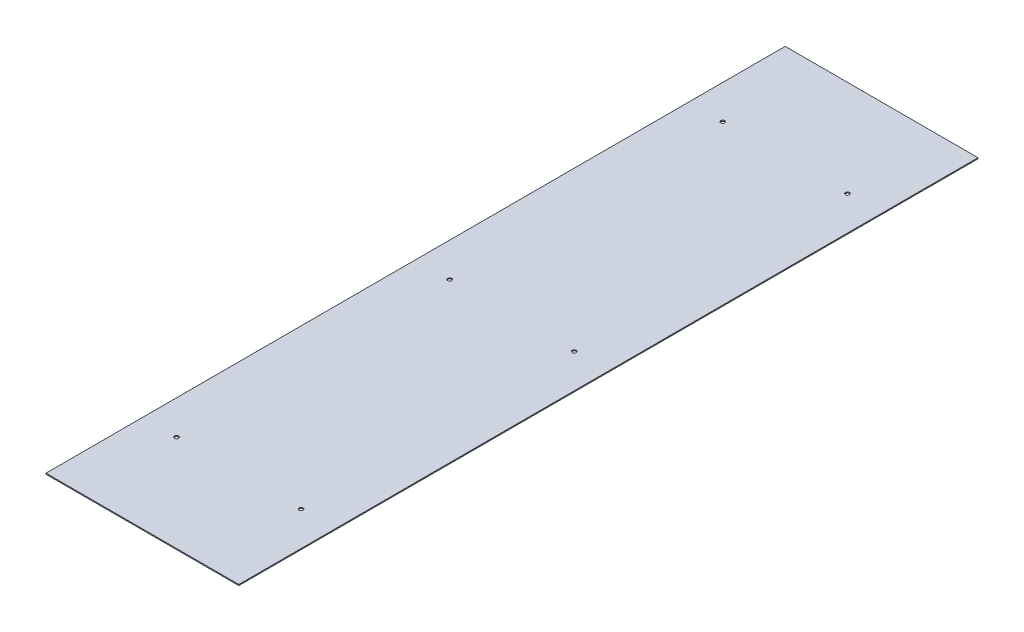
ISO-10303-21;
HEADER;
FILE_DESCRIPTION(('STEP AP214'),'2;1');
FILE_NAME('part.step','',(''),(''),'','','');
FILE_SCHEMA(('AUTOMOTIVE_DESIGN { 1 0 10303 214 1 1 1 1 }'));
ENDSEC;
DATA;
#1=APPLICATION_CONTEXT('core data for automotive mechanical design processes');
#2=APPLICATION_PROTOCOL_DEFINITION('international standard','automotive_design',2000,#1);
#3=PRODUCT_CONTEXT('',#1,'mechanical');
#4=PRODUCT('Part','Part','',(#3));
#5=PRODUCT_RELATED_PRODUCT_CATEGORY('part','',(#4));
#6=PRODUCT_DEFINITION_FORMATION('','',#4);
#7=PRODUCT_DEFINITION_CONTEXT('part definition',#1,'design');
#8=PRODUCT_DEFINITION('design','',#6,#7);
#9=PRODUCT_DEFINITION_SHAPE('','',#8);
#10=(LENGTH_UNIT() NAMED_UNIT(*) SI_UNIT(.MILLI.,.METRE.));
#11=(NAMED_UNIT(*) PLANE_ANGLE_UNIT() SI_UNIT($,.RADIAN.));
#12=(NAMED_UNIT(*) SI_UNIT($,.STERADIAN.) SOLID_ANGLE_UNIT());
#13=UNCERTAINTY_MEASURE_WITH_UNIT(LENGTH_MEASURE(1.E-05),#10,'distance_accuracy_value','');
#14=(GEOMETRIC_REPRESENTATION_CONTEXT(3) GLOBAL_UNCERTAINTY_ASSIGNED_CONTEXT((#13)) GLOBAL_UNIT_ASSIGNED_CONTEXT((#10,
#11,#12)) REPRESENTATION_CONTEXT('',''));
#15=CARTESIAN_POINT('',(0.,0.,0.));
#16=DIRECTION('',(0.,0.,1.));
#17=DIRECTION('',(1.,0.,0.));
#18=AXIS2_PLACEMENT_3D('',#15,#16,#17);
#19=CARTESIAN_POINT('',(4380.94840105623,-1.5875,584.2));
#20=DIRECTION('',(-1.,0.,0.));
#21=DIRECTION('',(0.,0.,1.));
#22=AXIS2_PLACEMENT_3D('',#19,#20,#21);
#23=PLANE('',#22);
#24=DIRECTION('',(0.,0.,1.));
#25=VECTOR('',#24,1.);
#26=CARTESIAN_POINT('',(4380.94840105623,0.,584.2));
#27=LINE('',#26,#25);
#28=CARTESIAN_POINT('',(4380.94840105623,0.,0.));
#29=VERTEX_POINT('',#28);
#30=CARTESIAN_POINT('',(4380.94840105623,0.,1168.4));
#31=VERTEX_POINT('',#30);
#32=EDGE_CURVE('E104',#29,#31,#27,.T.);
#33=ORIENTED_EDGE('',*,*,#32,.F.);
#34=DIRECTION('',(0.,1.,0.));
#35=VECTOR('',#34,1.);
#36=CARTESIAN_POINT('',(4380.94840105623,-1.5875,0.));
#37=LINE('',#36,#35);
#38=CARTESIAN_POINT('',(4380.94840105623,-1.5875,0.));
#39=VERTEX_POINT('',#38);
#40=EDGE_CURVE('E11',#39,#29,#37,.T.);
#41=ORIENTED_EDGE('',*,*,#40,.F.);
#42=DIRECTION('',(0.,0.,1.));
#43=VECTOR('',#42,1.);
#44=CARTESIAN_POINT('',(4380.94840105623,-1.5875,584.2));
#45=LINE('',#44,#43);
#46=CARTESIAN_POINT('',(4380.94840105623,-1.5875,1168.4));
#47=VERTEX_POINT('',#46);
#48=EDGE_CURVE('E81',#39,#47,#45,.T.);
#49=ORIENTED_EDGE('',*,*,#48,.T.);
#50=DIRECTION('',(0.,1.,0.));
#51=VECTOR('',#50,1.);
#52=CARTESIAN_POINT('',(4380.94840105623,-1.5875,1168.4));
#53=LINE('',#52,#51);
#54=EDGE_CURVE('E40',#47,#31,#53,.T.);
#55=ORIENTED_EDGE('',*,*,#54,.T.);
#56=EDGE_LOOP('',(#33,#41,#49,#55));
#57=FACE_BOUND('',#56,.T.);
#58=ADVANCED_FACE('F16',(#57),#23,.T.);
#59=CARTESIAN_POINT('',(4533.34840105623,-1.5875,0.));
#60=DIRECTION('',(0.,0.,1.));
#61=DIRECTION('',(1.,0.,0.));
#62=AXIS2_PLACEMENT_3D('',#59,#60,#61);
#63=PLANE('',#62);
#64=DIRECTION('',(1.,0.,0.));
#65=VECTOR('',#64,1.);
#66=CARTESIAN_POINT('',(4533.34840105623,0.,0.));
#67=LINE('',#66,#65);
#68=CARTESIAN_POINT('',(4685.74840105623,0.,0.));
#69=VERTEX_POINT('',#68);
#70=EDGE_CURVE('E88',#29,#69,#67,.T.);
#71=ORIENTED_EDGE('',*,*,#70,.T.);
#72=DIRECTION('',(0.,1.,0.));
#73=VECTOR('',#72,1.);
#74=CARTESIAN_POINT('',(4685.74840105623,-1.5875,0.));
#75=LINE('',#74,#73);
#76=CARTESIAN_POINT('',(4685.74840105623,-1.5875,0.));
#77=VERTEX_POINT('',#76);
#78=EDGE_CURVE('E26',#77,#69,#75,.T.);
#79=ORIENTED_EDGE('',*,*,#78,.F.);
#80=DIRECTION('',(1.,0.,0.));
#81=VECTOR('',#80,1.);
#82=CARTESIAN_POINT('',(4533.34840105623,-1.5875,0.));
#83=LINE('',#82,#81);
#84=EDGE_CURVE('E75',#39,#77,#83,.T.);
#85=ORIENTED_EDGE('',*,*,#84,.F.);
#86=ORIENTED_EDGE('',*,*,#40,.T.);
#87=EDGE_LOOP('',(#71,#79,#85,#86));
#88=FACE_BOUND('',#87,.T.);
#89=ADVANCED_FACE('F86',(#88),#63,.F.);
#90=CARTESIAN_POINT('',(4685.74840105623,-1.5875,584.2));
#91=DIRECTION('',(-1.,0.,0.));
#92=DIRECTION('',(0.,0.,1.));
#93=AXIS2_PLACEMENT_3D('',#90,#91,#92);
#94=PLANE('',#93);
#95=DIRECTION('',(0.,0.,1.));
#96=VECTOR('',#95,1.);
#97=CARTESIAN_POINT('',(4685.74840105623,0.,584.2));
#98=LINE('',#97,#96);
#99=CARTESIAN_POINT('',(4685.74840105623,0.,1168.4));
#100=VERTEX_POINT('',#99);
#101=EDGE_CURVE('E110',#69,#100,#98,.T.);
#102=ORIENTED_EDGE('',*,*,#101,.T.);
#103=DIRECTION('',(0.,1.,0.));
#104=VECTOR('',#103,1.);
#105=CARTESIAN_POINT('',(4685.74840105623,-1.5875,1168.4));
#106=LINE('',#105,#104);
#107=CARTESIAN_POINT('',(4685.74840105623,-1.5875,1168.4));
#108=VERTEX_POINT('',#107);
#109=EDGE_CURVE('E58',#108,#100,#106,.T.);
#110=ORIENTED_EDGE('',*,*,#109,.F.);
#111=DIRECTION('',(0.,0.,1.));
#112=VECTOR('',#111,1.);
#113=CARTESIAN_POINT('',(4685.74840105623,-1.5875,584.2));
#114=LINE('',#113,#112);
#115=EDGE_CURVE('E80',#77,#108,#114,.T.);
#116=ORIENTED_EDGE('',*,*,#115,.F.);
#117=ORIENTED_EDGE('',*,*,#78,.T.);
#118=EDGE_LOOP('',(#102,#110,#116,#117));
#119=FACE_BOUND('',#118,.T.);
#120=ADVANCED_FACE('F93',(#119),#94,.F.);
#121=CARTESIAN_POINT('',(4533.34840105623,-1.5875,1168.4));
#122=DIRECTION('',(0.,0.,1.));
#123=DIRECTION('',(1.,0.,0.));
#124=AXIS2_PLACEMENT_3D('',#121,#122,#123);
#125=PLANE('',#124);
#126=DIRECTION('',(1.,0.,0.));
#127=VECTOR('',#126,1.);
#128=CARTESIAN_POINT('',(4533.34840105623,0.,1168.4));
#129=LINE('',#128,#127);
#130=EDGE_CURVE('E112',#31,#100,#129,.T.);
#131=ORIENTED_EDGE('',*,*,#130,.F.);
#132=ORIENTED_EDGE('',*,*,#54,.F.);
#133=DIRECTION('',(1.,0.,0.));
#134=VECTOR('',#133,1.);
#135=CARTESIAN_POINT('',(4533.34840105623,-1.5875,1168.4));
#136=LINE('',#135,#134);
#137=EDGE_CURVE('E95',#47,#108,#136,.T.);
#138=ORIENTED_EDGE('',*,*,#137,.T.);
#139=ORIENTED_EDGE('',*,*,#109,.T.);
#140=EDGE_LOOP('',(#131,#132,#138,#139));
#141=FACE_BOUND('',#140,.T.);
#142=ADVANCED_FACE('F171',(#141),#125,.T.);
#143=CARTESIAN_POINT('',(4533.34840105623,-1.5875,584.2));
#144=DIRECTION('',(0.,-1.,0.));
#145=DIRECTION('',(1.,0.,0.));
#146=AXIS2_PLACEMENT_3D('',#143,#144,#145);
#147=PLANE('',#146);
#148=CARTESIAN_POINT('',(4631.77340105623,-1.58750000000007,584.2));
#149=DIRECTION('',(0.,-1.,0.));
#150=DIRECTION('',(0.,0.,-1.));
#151=AXIS2_PLACEMENT_3D('',#148,#149,#150);
#152=CIRCLE('',#151,3.1749999999997);
#153=CARTESIAN_POINT('',(4631.77340105623,-1.58750000000007,581.025));
#154=VERTEX_POINT('',#153);
#155=EDGE_CURVE('E158',#154,#154,#152,.T.);
#156=ORIENTED_EDGE('',*,*,#155,.F.);
#157=EDGE_LOOP('',(#156));
#158=FACE_BOUND('',#157,.T.);
#159=CARTESIAN_POINT('',(4434.92340105623,-1.58750000000007,584.2));
#160=DIRECTION('',(0.,-1.,0.));
#161=DIRECTION('',(0.,0.,-1.));
#162=AXIS2_PLACEMENT_3D('',#159,#160,#161);
#163=CIRCLE('',#162,3.1749999999997);
#164=CARTESIAN_POINT('',(4434.92340105623,-1.58750000000007,581.025));
#165=VERTEX_POINT('',#164);
#166=EDGE_CURVE('E141',#165,#165,#163,.T.);
#167=ORIENTED_EDGE('',*,*,#166,.F.);
#168=EDGE_LOOP('',(#167));
#169=FACE_BOUND('',#168,.T.);
#170=CARTESIAN_POINT('',(4631.77340105623,-1.58750000000007,152.4));
#171=DIRECTION('',(0.,-1.,0.));
#172=DIRECTION('',(0.,0.,-1.));
#173=AXIS2_PLACEMENT_3D('',#170,#171,#172);
#174=CIRCLE('',#173,3.1749999999997);
#175=CARTESIAN_POINT('',(4631.77340105623,-1.58750000000007,149.225));
#176=VERTEX_POINT('',#175);
#177=EDGE_CURVE('E137',#176,#176,#174,.T.);
#178=ORIENTED_EDGE('',*,*,#177,.F.);
#179=EDGE_LOOP('',(#178));
#180=FACE_BOUND('',#179,.T.);
#181=CARTESIAN_POINT('',(4434.92340105623,-1.58750000000007,152.4));
#182=DIRECTION('',(0.,-1.,0.));
#183=DIRECTION('',(0.,0.,-1.));
#184=AXIS2_PLACEMENT_3D('',#181,#182,#183);
#185=CIRCLE('',#184,3.1749999999997);
#186=CARTESIAN_POINT('',(4434.92340105623,-1.58750000000007,149.225));
#187=VERTEX_POINT('',#186);
#188=EDGE_CURVE('E133',#187,#187,#185,.T.);
#189=ORIENTED_EDGE('',*,*,#188,.F.);
#190=EDGE_LOOP('',(#189));
#191=FACE_BOUND('',#190,.T.);
#192=CARTESIAN_POINT('',(4631.77340105623,-1.58750000000007,1016.));
#193=DIRECTION('',(0.,-1.,0.));
#194=DIRECTION('',(0.,0.,-1.));
#195=AXIS2_PLACEMENT_3D('',#192,#193,#194);
#196=CIRCLE('',#195,3.1749999999997);
#197=CARTESIAN_POINT('',(4631.77340105623,-1.58750000000007,1012.825));
#198=VERTEX_POINT('',#197);
#199=EDGE_CURVE('E128',#198,#198,#196,.T.);
#200=ORIENTED_EDGE('',*,*,#199,.F.);
#201=EDGE_LOOP('',(#200));
#202=FACE_BOUND('',#201,.T.);
#203=CARTESIAN_POINT('',(4434.92340105623,-1.58750000000007,1016.));
#204=DIRECTION('',(0.,-1.,0.));
#205=DIRECTION('',(0.,0.,-1.));
#206=AXIS2_PLACEMENT_3D('',#203,#204,#205);
#207=CIRCLE('',#206,3.1749999999997);
#208=CARTESIAN_POINT('',(4434.92340105623,-1.58750000000007,1012.825));
#209=VERTEX_POINT('',#208);
#210=EDGE_CURVE('E123',#209,#209,#207,.T.);
#211=ORIENTED_EDGE('',*,*,#210,.F.);
#212=EDGE_LOOP('',(#211));
#213=FACE_BOUND('',#212,.T.);
#214=ORIENTED_EDGE('',*,*,#48,.F.);
#215=ORIENTED_EDGE('',*,*,#84,.T.);
#216=ORIENTED_EDGE('',*,*,#115,.T.);
#217=ORIENTED_EDGE('',*,*,#137,.F.);
#218=EDGE_LOOP('',(#214,#215,#216,#217));
#219=FACE_BOUND('',#218,.T.);
#220=ADVANCED_FACE('F77',(#158,#169,#180,#191,#202,#213,#219),#147,.T.);
#221=CARTESIAN_POINT('',(4533.34840105623,0.,584.2));
#222=DIRECTION('',(0.,-1.,0.));
#223=DIRECTION('',(1.,0.,0.));
#224=AXIS2_PLACEMENT_3D('',#221,#222,#223);
#225=PLANE('',#224);
#226=CARTESIAN_POINT('',(4631.77340105623,0.,584.2));
#227=DIRECTION('',(0.,-1.,0.));
#228=DIRECTION('',(0.,0.,-1.));
#229=AXIS2_PLACEMENT_3D('',#226,#227,#228);
#230=CIRCLE('',#229,3.1749999999997);
#231=CARTESIAN_POINT('',(4631.77340105623,0.,581.025));
#232=VERTEX_POINT('',#231);
#233=EDGE_CURVE('E19',#232,#232,#230,.F.);
#234=ORIENTED_EDGE('',*,*,#233,.F.);
#235=EDGE_LOOP('',(#234));
#236=FACE_BOUND('',#235,.T.);
#237=CARTESIAN_POINT('',(4434.92340105623,0.,584.2));
#238=DIRECTION('',(0.,-1.,0.));
#239=DIRECTION('',(0.,0.,-1.));
#240=AXIS2_PLACEMENT_3D('',#237,#238,#239);
#241=CIRCLE('',#240,3.1749999999997);
#242=CARTESIAN_POINT('',(4434.92340105623,0.,581.025));
#243=VERTEX_POINT('',#242);
#244=EDGE_CURVE('E138',#243,#243,#241,.F.);
#245=ORIENTED_EDGE('',*,*,#244,.F.);
#246=EDGE_LOOP('',(#245));
#247=FACE_BOUND('',#246,.T.);
#248=CARTESIAN_POINT('',(4631.77340105623,0.,152.4));
#249=DIRECTION('',(0.,-1.,0.));
#250=DIRECTION('',(0.,0.,-1.));
#251=AXIS2_PLACEMENT_3D('',#248,#249,#250);
#252=CIRCLE('',#251,3.1749999999997);
#253=CARTESIAN_POINT('',(4631.77340105623,0.,149.225));
#254=VERTEX_POINT('',#253);
#255=EDGE_CURVE('E134',#254,#254,#252,.F.);
#256=ORIENTED_EDGE('',*,*,#255,.F.);
#257=EDGE_LOOP('',(#256));
#258=FACE_BOUND('',#257,.T.);
#259=CARTESIAN_POINT('',(4434.92340105623,0.,152.4));
#260=DIRECTION('',(0.,-1.,0.));
#261=DIRECTION('',(0.,0.,-1.));
#262=AXIS2_PLACEMENT_3D('',#259,#260,#261);
#263=CIRCLE('',#262,3.1749999999997);
#264=CARTESIAN_POINT('',(4434.92340105623,0.,149.225));
#265=VERTEX_POINT('',#264);
#266=EDGE_CURVE('E129',#265,#265,#263,.F.);
#267=ORIENTED_EDGE('',*,*,#266,.F.);
#268=EDGE_LOOP('',(#267));
#269=FACE_BOUND('',#268,.T.);
#270=CARTESIAN_POINT('',(4631.77340105623,0.,1016.));
#271=DIRECTION('',(0.,-1.,0.));
#272=DIRECTION('',(0.,0.,-1.));
#273=AXIS2_PLACEMENT_3D('',#270,#271,#272);
#274=CIRCLE('',#273,3.1749999999997);
#275=CARTESIAN_POINT('',(4631.77340105623,0.,1012.825));
#276=VERTEX_POINT('',#275);
#277=EDGE_CURVE('E124',#276,#276,#274,.F.);
#278=ORIENTED_EDGE('',*,*,#277,.F.);
#279=EDGE_LOOP('',(#278));
#280=FACE_BOUND('',#279,.T.);
#281=CARTESIAN_POINT('',(4434.92340105623,0.,1016.));
#282=DIRECTION('',(0.,-1.,0.));
#283=DIRECTION('',(0.,0.,-1.));
#284=AXIS2_PLACEMENT_3D('',#281,#282,#283);
#285=CIRCLE('',#284,3.1749999999997);
#286=CARTESIAN_POINT('',(4434.92340105623,0.,1012.825));
#287=VERTEX_POINT('',#286);
#288=EDGE_CURVE('E107',#287,#287,#285,.F.);
#289=ORIENTED_EDGE('',*,*,#288,.F.);
#290=EDGE_LOOP('',(#289));
#291=FACE_BOUND('',#290,.T.);
#292=ORIENTED_EDGE('',*,*,#32,.T.);
#293=ORIENTED_EDGE('',*,*,#130,.T.);
#294=ORIENTED_EDGE('',*,*,#101,.F.);
#295=ORIENTED_EDGE('',*,*,#70,.F.);
#296=EDGE_LOOP('',(#292,#293,#294,#295));
#297=FACE_BOUND('',#296,.T.);
#298=ADVANCED_FACE('F179',(#236,#247,#258,#269,#280,#291,#297),#225,.F.);
#299=CARTESIAN_POINT('',(4434.92340105623,1206.86962509218,1016.));
#300=DIRECTION('',(0.,-1.,0.));
#301=DIRECTION('',(0.,0.,-1.));
#302=AXIS2_PLACEMENT_3D('',#299,#300,#301);
#303=CYLINDRICAL_SURFACE('',#302,3.1749999999997);
#304=ORIENTED_EDGE('',*,*,#210,.T.);
#305=EDGE_LOOP('',(#304));
#306=FACE_BOUND('',#305,.T.);
#307=ORIENTED_EDGE('',*,*,#288,.T.);
#308=EDGE_LOOP('',(#307));
#309=FACE_BOUND('',#308,.T.);
#310=ADVANCED_FACE('F221',(#306,#309),#303,.F.);
#311=CARTESIAN_POINT('',(4631.77340105623,1206.86962509218,1016.));
#312=DIRECTION('',(0.,-1.,0.));
#313=DIRECTION('',(0.,0.,-1.));
#314=AXIS2_PLACEMENT_3D('',#311,#312,#313);
#315=CYLINDRICAL_SURFACE('',#314,3.1749999999997);
#316=ORIENTED_EDGE('',*,*,#199,.T.);
#317=EDGE_LOOP('',(#316));
#318=FACE_BOUND('',#317,.T.);
#319=ORIENTED_EDGE('',*,*,#277,.T.);
#320=EDGE_LOOP('',(#319));
#321=FACE_BOUND('',#320,.T.);
#322=ADVANCED_FACE('F231',(#318,#321),#315,.F.);
#323=CARTESIAN_POINT('',(4434.92340105623,1206.86962509218,152.4));
#324=DIRECTION('',(0.,-1.,0.));
#325=DIRECTION('',(0.,0.,-1.));
#326=AXIS2_PLACEMENT_3D('',#323,#324,#325);
#327=CYLINDRICAL_SURFACE('',#326,3.1749999999997);
#328=ORIENTED_EDGE('',*,*,#188,.T.);
#329=EDGE_LOOP('',(#328));
#330=FACE_BOUND('',#329,.T.);
#331=ORIENTED_EDGE('',*,*,#266,.T.);
#332=EDGE_LOOP('',(#331));
#333=FACE_BOUND('',#332,.T.);
#334=ADVANCED_FACE('F242',(#330,#333),#327,.F.);
#335=CARTESIAN_POINT('',(4631.77340105623,1206.86962509218,152.4));
#336=DIRECTION('',(0.,-1.,0.));
#337=DIRECTION('',(0.,0.,-1.));
#338=AXIS2_PLACEMENT_3D('',#335,#336,#337);
#339=CYLINDRICAL_SURFACE('',#338,3.1749999999997);
#340=ORIENTED_EDGE('',*,*,#177,.T.);
#341=EDGE_LOOP('',(#340));
#342=FACE_BOUND('',#341,.T.);
#343=ORIENTED_EDGE('',*,*,#255,.T.);
#344=EDGE_LOOP('',(#343));
#345=FACE_BOUND('',#344,.T.);
#346=ADVANCED_FACE('F253',(#342,#345),#339,.F.);
#347=CARTESIAN_POINT('',(4434.92340105623,1206.86962509218,584.2));
#348=DIRECTION('',(0.,-1.,0.));
#349=DIRECTION('',(0.,0.,-1.));
#350=AXIS2_PLACEMENT_3D('',#347,#348,#349);
#351=CYLINDRICAL_SURFACE('',#350,3.1749999999997);
#352=ORIENTED_EDGE('',*,*,#166,.T.);
#353=EDGE_LOOP('',(#352));
#354=FACE_BOUND('',#353,.T.);
#355=ORIENTED_EDGE('',*,*,#244,.T.);
#356=EDGE_LOOP('',(#355));
#357=FACE_BOUND('',#356,.T.);
#358=ADVANCED_FACE('F264',(#354,#357),#351,.F.);
#359=CARTESIAN_POINT('',(4631.77340105623,1206.86962509218,584.2));
#360=DIRECTION('',(0.,-1.,0.));
#361=DIRECTION('',(0.,0.,-1.));
#362=AXIS2_PLACEMENT_3D('',#359,#360,#361);
#363=CYLINDRICAL_SURFACE('',#362,3.1749999999997);
#364=ORIENTED_EDGE('',*,*,#155,.T.);
#365=EDGE_LOOP('',(#364));
#366=FACE_BOUND('',#365,.T.);
#367=ORIENTED_EDGE('',*,*,#233,.T.);
#368=EDGE_LOOP('',(#367));
#369=FACE_BOUND('',#368,.T.);
#370=ADVANCED_FACE('F274',(#366,#369),#363,.F.);
#371=CLOSED_SHELL('',(#58,#89,#120,#142,#220,#298,#310,#322,#334,#346,#358,#370));
#372=MANIFOLD_SOLID_BREP('B1',#371);
#373=ADVANCED_BREP_SHAPE_REPRESENTATION('',(#18,#372),#14);
#374=SHAPE_DEFINITION_REPRESENTATION(#9,#373);
ENDSEC;
END-ISO-10303-21;
